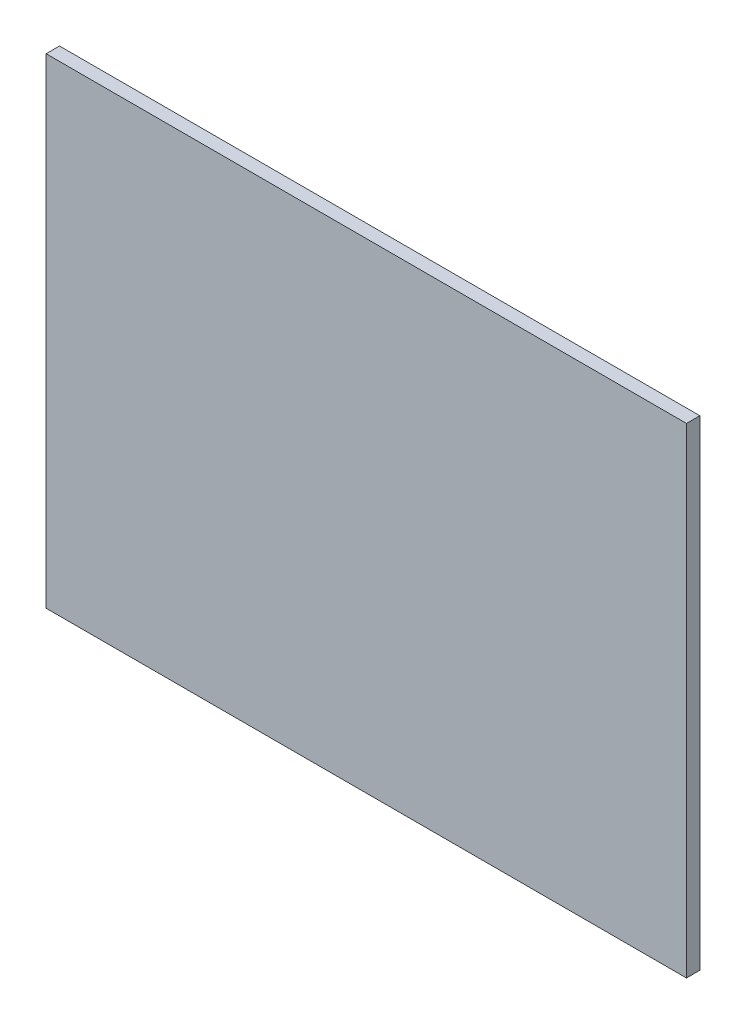
ISO-10303-21;
HEADER;
FILE_DESCRIPTION(('STEP AP214'),'2;1');
FILE_NAME('part.step','',(''),(''),'','','');
FILE_SCHEMA(('AUTOMOTIVE_DESIGN { 1 0 10303 214 1 1 1 1 }'));
ENDSEC;
DATA;
#1=APPLICATION_CONTEXT('core data for automotive mechanical design processes');
#2=APPLICATION_PROTOCOL_DEFINITION('international standard','automotive_design',2000,#1);
#3=PRODUCT_CONTEXT('',#1,'mechanical');
#4=PRODUCT('Part','Part','',(#3));
#5=PRODUCT_RELATED_PRODUCT_CATEGORY('part','',(#4));
#6=PRODUCT_DEFINITION_FORMATION('','',#4);
#7=PRODUCT_DEFINITION_CONTEXT('part definition',#1,'design');
#8=PRODUCT_DEFINITION('design','',#6,#7);
#9=PRODUCT_DEFINITION_SHAPE('','',#8);
#10=(LENGTH_UNIT() NAMED_UNIT(*) SI_UNIT(.MILLI.,.METRE.));
#11=(NAMED_UNIT(*) PLANE_ANGLE_UNIT() SI_UNIT($,.RADIAN.));
#12=(NAMED_UNIT(*) SI_UNIT($,.STERADIAN.) SOLID_ANGLE_UNIT());
#13=UNCERTAINTY_MEASURE_WITH_UNIT(LENGTH_MEASURE(1.E-05),#10,'distance_accuracy_value','');
#14=(GEOMETRIC_REPRESENTATION_CONTEXT(3) GLOBAL_UNCERTAINTY_ASSIGNED_CONTEXT((#13)) GLOBAL_UNIT_ASSIGNED_CONTEXT((#10,
#11,#12)) REPRESENTATION_CONTEXT('',''));
#15=CARTESIAN_POINT('',(0.,0.,0.));
#16=DIRECTION('',(0.,0.,1.));
#17=DIRECTION('',(1.,0.,0.));
#18=AXIS2_PLACEMENT_3D('',#15,#16,#17);
#19=CARTESIAN_POINT('',(76.2,57.15,3.18));
#20=DIRECTION('',(-1.,0.,0.));
#21=DIRECTION('',(0.,0.,1.));
#22=AXIS2_PLACEMENT_3D('',#19,#20,#21);
#23=PLANE('',#22);
#24=DIRECTION('',(0.,1.,0.));
#25=VECTOR('',#24,1.);
#26=CARTESIAN_POINT('',(76.2,57.15,0.));
#27=LINE('',#26,#25);
#28=CARTESIAN_POINT('',(76.2,-57.15,0.));
#29=VERTEX_POINT('',#28);
#30=CARTESIAN_POINT('',(76.2,57.15,0.));
#31=VERTEX_POINT('',#30);
#32=EDGE_CURVE('E109',#29,#31,#27,.T.);
#33=ORIENTED_EDGE('',*,*,#32,.T.);
#34=DIRECTION('',(0.,0.,-1.));
#35=VECTOR('',#34,1.);
#36=CARTESIAN_POINT('',(76.2,57.15,3.18));
#37=LINE('',#36,#35);
#38=CARTESIAN_POINT('',(76.2,57.15,3.18));
#39=VERTEX_POINT('',#38);
#40=EDGE_CURVE('E11',#39,#31,#37,.T.);
#41=ORIENTED_EDGE('',*,*,#40,.F.);
#42=DIRECTION('',(0.,1.,0.));
#43=VECTOR('',#42,1.);
#44=CARTESIAN_POINT('',(76.2,57.15,3.18));
#45=LINE('',#44,#43);
#46=CARTESIAN_POINT('',(76.2,-57.15,3.18));
#47=VERTEX_POINT('',#46);
#48=EDGE_CURVE('E93',#47,#39,#45,.T.);
#49=ORIENTED_EDGE('',*,*,#48,.F.);
#50=DIRECTION('',(0.,0.,-1.));
#51=VECTOR('',#50,1.);
#52=CARTESIAN_POINT('',(76.2,-57.15,3.18));
#53=LINE('',#52,#51);
#54=EDGE_CURVE('E105',#47,#29,#53,.T.);
#55=ORIENTED_EDGE('',*,*,#54,.T.);
#56=EDGE_LOOP('',(#33,#41,#49,#55));
#57=FACE_BOUND('',#56,.T.);
#58=ADVANCED_FACE('F41',(#57),#23,.F.);
#59=CARTESIAN_POINT('',(-76.2,57.15,3.18));
#60=DIRECTION('',(0.,-1.,0.));
#61=DIRECTION('',(0.,0.,-1.));
#62=AXIS2_PLACEMENT_3D('',#59,#60,#61);
#63=PLANE('',#62);
#64=DIRECTION('',(-1.,0.,0.));
#65=VECTOR('',#64,1.);
#66=CARTESIAN_POINT('',(-76.2,57.15,0.));
#67=LINE('',#66,#65);
#68=CARTESIAN_POINT('',(-76.2,57.15,0.));
#69=VERTEX_POINT('',#68);
#70=EDGE_CURVE('E98',#31,#69,#67,.T.);
#71=ORIENTED_EDGE('',*,*,#70,.T.);
#72=DIRECTION('',(0.,0.,-1.));
#73=VECTOR('',#72,1.);
#74=CARTESIAN_POINT('',(-76.2,57.15,3.18));
#75=LINE('',#74,#73);
#76=CARTESIAN_POINT('',(-76.2,57.15,3.18));
#77=VERTEX_POINT('',#76);
#78=EDGE_CURVE('E50',#77,#69,#75,.T.);
#79=ORIENTED_EDGE('',*,*,#78,.F.);
#80=DIRECTION('',(-1.,0.,0.));
#81=VECTOR('',#80,1.);
#82=CARTESIAN_POINT('',(-76.2,57.15,3.18));
#83=LINE('',#82,#81);
#84=EDGE_CURVE('E88',#39,#77,#83,.T.);
#85=ORIENTED_EDGE('',*,*,#84,.F.);
#86=ORIENTED_EDGE('',*,*,#40,.T.);
#87=EDGE_LOOP('',(#71,#79,#85,#86));
#88=FACE_BOUND('',#87,.T.);
#89=ADVANCED_FACE('F97',(#88),#63,.F.);
#90=CARTESIAN_POINT('',(-76.2,57.15,3.18));
#91=DIRECTION('',(1.,0.,0.));
#92=DIRECTION('',(0.,1.,0.));
#93=AXIS2_PLACEMENT_3D('',#90,#91,#92);
#94=PLANE('',#93);
#95=DIRECTION('',(0.,-1.,0.));
#96=VECTOR('',#95,1.);
#97=CARTESIAN_POINT('',(-76.2,57.15,0.));
#98=LINE('',#97,#96);
#99=CARTESIAN_POINT('',(-76.2,-57.15,0.));
#100=VERTEX_POINT('',#99);
#101=EDGE_CURVE('E75',#69,#100,#98,.T.);
#102=ORIENTED_EDGE('',*,*,#101,.T.);
#103=DIRECTION('',(0.,0.,-1.));
#104=VECTOR('',#103,1.);
#105=CARTESIAN_POINT('',(-76.2,-57.15,3.18));
#106=LINE('',#105,#104);
#107=CARTESIAN_POINT('',(-76.2,-57.15,3.18));
#108=VERTEX_POINT('',#107);
#109=EDGE_CURVE('E100',#108,#100,#106,.T.);
#110=ORIENTED_EDGE('',*,*,#109,.F.);
#111=DIRECTION('',(0.,-1.,0.));
#112=VECTOR('',#111,1.);
#113=CARTESIAN_POINT('',(-76.2,57.15,3.18));
#114=LINE('',#113,#112);
#115=EDGE_CURVE('E91',#77,#108,#114,.T.);
#116=ORIENTED_EDGE('',*,*,#115,.F.);
#117=ORIENTED_EDGE('',*,*,#78,.T.);
#118=EDGE_LOOP('',(#102,#110,#116,#117));
#119=FACE_BOUND('',#118,.T.);
#120=ADVANCED_FACE('F101',(#119),#94,.F.);
#121=CARTESIAN_POINT('',(-76.2,-57.15,3.18));
#122=DIRECTION('',(0.,1.,0.));
#123=DIRECTION('',(0.,0.,1.));
#124=AXIS2_PLACEMENT_3D('',#121,#122,#123);
#125=PLANE('',#124);
#126=DIRECTION('',(1.,0.,0.));
#127=VECTOR('',#126,1.);
#128=CARTESIAN_POINT('',(-76.2,-57.15,0.));
#129=LINE('',#128,#127);
#130=EDGE_CURVE('E81',#100,#29,#129,.T.);
#131=ORIENTED_EDGE('',*,*,#130,.T.);
#132=ORIENTED_EDGE('',*,*,#54,.F.);
#133=DIRECTION('',(1.,0.,0.));
#134=VECTOR('',#133,1.);
#135=CARTESIAN_POINT('',(-76.2,-57.15,3.18));
#136=LINE('',#135,#134);
#137=EDGE_CURVE('E58',#108,#47,#136,.T.);
#138=ORIENTED_EDGE('',*,*,#137,.F.);
#139=ORIENTED_EDGE('',*,*,#109,.T.);
#140=EDGE_LOOP('',(#131,#132,#138,#139));
#141=FACE_BOUND('',#140,.T.);
#142=ADVANCED_FACE('F122',(#141),#125,.F.);
#143=CARTESIAN_POINT('',(0.,0.,3.18));
#144=DIRECTION('',(0.,0.,1.));
#145=DIRECTION('',(1.,0.,0.));
#146=AXIS2_PLACEMENT_3D('',#143,#144,#145);
#147=PLANE('',#146);
#148=ORIENTED_EDGE('',*,*,#48,.T.);
#149=ORIENTED_EDGE('',*,*,#84,.T.);
#150=ORIENTED_EDGE('',*,*,#115,.T.);
#151=ORIENTED_EDGE('',*,*,#137,.T.);
#152=EDGE_LOOP('',(#148,#149,#150,#151));
#153=FACE_BOUND('',#152,.T.);
#154=ADVANCED_FACE('F89',(#153),#147,.T.);
#155=CARTESIAN_POINT('',(0.,0.,0.));
#156=DIRECTION('',(0.,0.,1.));
#157=DIRECTION('',(1.,0.,0.));
#158=AXIS2_PLACEMENT_3D('',#155,#156,#157);
#159=PLANE('',#158);
#160=ORIENTED_EDGE('',*,*,#32,.F.);
#161=ORIENTED_EDGE('',*,*,#130,.F.);
#162=ORIENTED_EDGE('',*,*,#101,.F.);
#163=ORIENTED_EDGE('',*,*,#70,.F.);
#164=EDGE_LOOP('',(#160,#161,#162,#163));
#165=FACE_BOUND('',#164,.T.);
#166=ADVANCED_FACE('F125',(#165),#159,.F.);
#167=CLOSED_SHELL('',(#58,#89,#120,#142,#154,#166));
#168=MANIFOLD_SOLID_BREP('B2',#167);
#169=ADVANCED_BREP_SHAPE_REPRESENTATION('',(#18,#168),#14);
#170=SHAPE_DEFINITION_REPRESENTATION(#9,#169);
ENDSEC;
END-ISO-10303-21;
